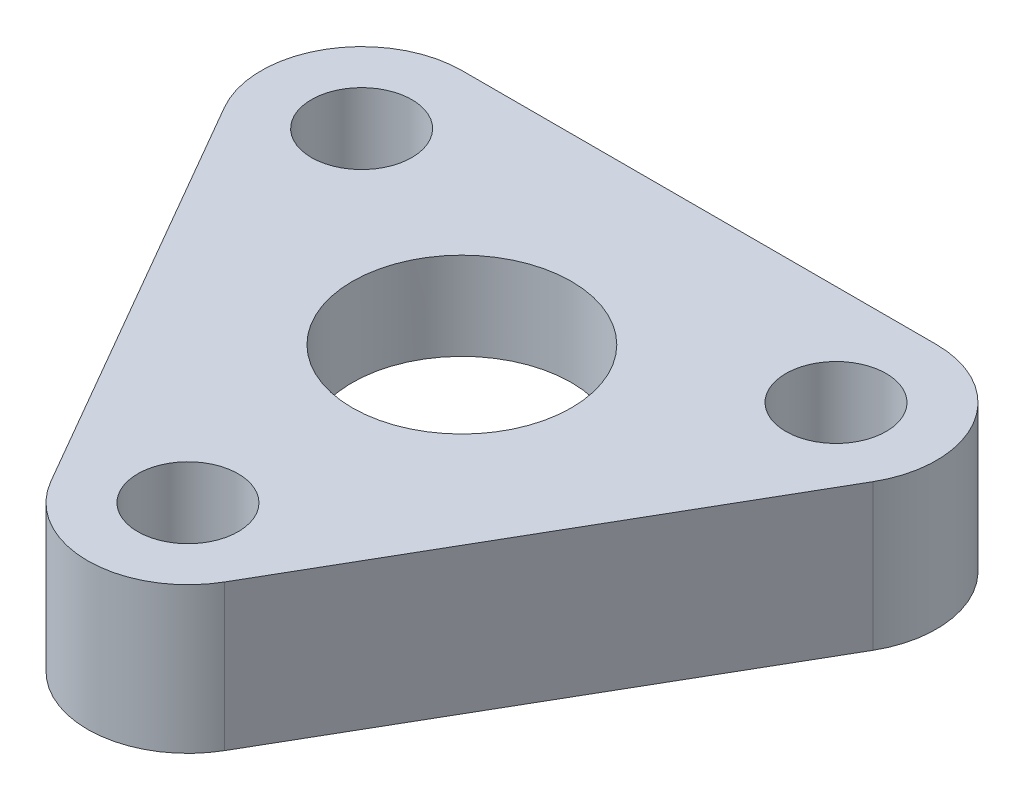
ISO-10303-21;
HEADER;
FILE_DESCRIPTION(('STEP AP214'),'2;1');
FILE_NAME('part.step','',(''),(''),'','','');
FILE_SCHEMA(('AUTOMOTIVE_DESIGN { 1 0 10303 214 1 1 1 1 }'));
ENDSEC;
DATA;
#1=APPLICATION_CONTEXT('core data for automotive mechanical design processes');
#2=APPLICATION_PROTOCOL_DEFINITION('international standard','automotive_design',2000,#1);
#3=PRODUCT_CONTEXT('',#1,'mechanical');
#4=PRODUCT('Part','Part','',(#3));
#5=PRODUCT_RELATED_PRODUCT_CATEGORY('part','',(#4));
#6=PRODUCT_DEFINITION_FORMATION('','',#4);
#7=PRODUCT_DEFINITION_CONTEXT('part definition',#1,'design');
#8=PRODUCT_DEFINITION('design','',#6,#7);
#9=PRODUCT_DEFINITION_SHAPE('','',#8);
#10=(LENGTH_UNIT() NAMED_UNIT(*) SI_UNIT(.MILLI.,.METRE.));
#11=(NAMED_UNIT(*) PLANE_ANGLE_UNIT() SI_UNIT($,.RADIAN.));
#12=(NAMED_UNIT(*) SI_UNIT($,.STERADIAN.) SOLID_ANGLE_UNIT());
#13=UNCERTAINTY_MEASURE_WITH_UNIT(LENGTH_MEASURE(1.E-05),#10,'distance_accuracy_value','');
#14=(GEOMETRIC_REPRESENTATION_CONTEXT(3) GLOBAL_UNCERTAINTY_ASSIGNED_CONTEXT((#13)) GLOBAL_UNIT_ASSIGNED_CONTEXT((#10,
#11,#12)) REPRESENTATION_CONTEXT('',''));
#15=CARTESIAN_POINT('',(0.,0.,0.));
#16=DIRECTION('',(0.,0.,1.));
#17=DIRECTION('',(1.,0.,0.));
#18=AXIS2_PLACEMENT_3D('',#15,#16,#17);
#19=CARTESIAN_POINT('',(0.,8.,0.));
#20=DIRECTION('',(0.,-1.,0.));
#21=DIRECTION('',(0.,0.,-1.));
#22=AXIS2_PLACEMENT_3D('',#19,#20,#21);
#23=CYLINDRICAL_SURFACE('',#22,6.);
#24=CARTESIAN_POINT('',(0.,8.,0.));
#25=DIRECTION('',(0.,1.,0.));
#26=DIRECTION('',(0.,0.,1.));
#27=AXIS2_PLACEMENT_3D('',#24,#25,#26);
#28=CIRCLE('',#27,6.);
#29=CARTESIAN_POINT('',(0.,8.,6.));
#30=VERTEX_POINT('',#29);
#31=EDGE_CURVE('E125',#30,#30,#28,.T.);
#32=ORIENTED_EDGE('',*,*,#31,.T.);
#33=EDGE_LOOP('',(#32));
#34=FACE_BOUND('',#33,.T.);
#35=CARTESIAN_POINT('',(0.,3.2,0.));
#36=DIRECTION('',(0.,-1.,0.));
#37=DIRECTION('',(0.,0.,-1.));
#38=AXIS2_PLACEMENT_3D('',#35,#36,#37);
#39=CIRCLE('',#38,6.);
#40=CARTESIAN_POINT('',(0.,3.2,-6.));
#41=VERTEX_POINT('',#40);
#42=EDGE_CURVE('E38',#41,#41,#39,.T.);
#43=ORIENTED_EDGE('',*,*,#42,.T.);
#44=EDGE_LOOP('',(#43));
#45=FACE_BOUND('',#44,.T.);
#46=ADVANCED_FACE('F34',(#34,#45),#23,.F.);
#47=CARTESIAN_POINT('',(0.,8.,15.0000000000001));
#48=DIRECTION('',(0.,1.,0.));
#49=DIRECTION('',(0.,0.,1.));
#50=AXIS2_PLACEMENT_3D('',#47,#48,#49);
#51=PLANE('',#50);
#52=CARTESIAN_POINT('',(0.,8.,15.0000000000001));
#53=DIRECTION('',(0.,1.,0.));
#54=DIRECTION('',(0.,0.,1.));
#55=AXIS2_PLACEMENT_3D('',#52,#53,#54);
#56=CIRCLE('',#55,2.75000000000007);
#57=CARTESIAN_POINT('',(0.,8.,17.7500000000001));
#58=VERTEX_POINT('',#57);
#59=EDGE_CURVE('E193',#58,#58,#56,.T.);
#60=ORIENTED_EDGE('',*,*,#59,.F.);
#61=EDGE_LOOP('',(#60));
#62=FACE_BOUND('',#61,.T.);
#63=ORIENTED_EDGE('',*,*,#31,.F.);
#64=EDGE_LOOP('',(#63));
#65=FACE_BOUND('',#64,.T.);
#66=CARTESIAN_POINT('',(0.,8.,15.0000000000001));
#67=DIRECTION('',(0.,1.,0.));
#68=DIRECTION('',(0.,0.,1.));
#69=AXIS2_PLACEMENT_3D('',#66,#67,#68);
#70=CIRCLE('',#69,5.5);
#71=CARTESIAN_POINT('',(-4.76313972081441,8.,17.7500000000001));
#72=VERTEX_POINT('',#71);
#73=CARTESIAN_POINT('',(4.76313972081441,8.,17.7500000000001));
#74=VERTEX_POINT('',#73);
#75=EDGE_CURVE('E132',#72,#74,#70,.T.);
#76=ORIENTED_EDGE('',*,*,#75,.T.);
#77=DIRECTION('',(0.500000000000001,0.,-0.866025403784438));
#78=VECTOR('',#77,1.);
#79=CARTESIAN_POINT('',(4.76313972081441,8.,17.7500000000001));
#80=LINE('',#79,#78);
#81=CARTESIAN_POINT('',(17.7535207775811,8.,-4.75));
#82=VERTEX_POINT('',#81);
#83=EDGE_CURVE('E89',#74,#82,#80,.T.);
#84=ORIENTED_EDGE('',*,*,#83,.T.);
#85=CARTESIAN_POINT('',(12.9903810567667,8.,-7.5));
#86=DIRECTION('',(0.,1.,0.));
#87=DIRECTION('',(0.,0.,-1.));
#88=AXIS2_PLACEMENT_3D('',#85,#86,#87);
#89=CIRCLE('',#88,5.5);
#90=CARTESIAN_POINT('',(12.9903810567667,8.,-13.));
#91=VERTEX_POINT('',#90);
#92=EDGE_CURVE('E103',#82,#91,#89,.T.);
#93=ORIENTED_EDGE('',*,*,#92,.T.);
#94=DIRECTION('',(-1.,0.,0.));
#95=VECTOR('',#94,1.);
#96=CARTESIAN_POINT('',(-12.9903810567667,8.,-13.));
#97=LINE('',#96,#95);
#98=CARTESIAN_POINT('',(-12.9903810567667,8.,-13.));
#99=VERTEX_POINT('',#98);
#100=EDGE_CURVE('E96',#91,#99,#97,.T.);
#101=ORIENTED_EDGE('',*,*,#100,.T.);
#102=CARTESIAN_POINT('',(-12.9903810567667,8.,-7.5));
#103=DIRECTION('',(0.,1.,0.));
#104=DIRECTION('',(0.,0.,1.));
#105=AXIS2_PLACEMENT_3D('',#102,#103,#104);
#106=CIRCLE('',#105,5.5);
#107=CARTESIAN_POINT('',(-17.7535207775811,8.,-4.75));
#108=VERTEX_POINT('',#107);
#109=EDGE_CURVE('E101',#99,#108,#106,.T.);
#110=ORIENTED_EDGE('',*,*,#109,.T.);
#111=DIRECTION('',(0.500000000000001,0.,0.866025403784438));
#112=VECTOR('',#111,1.);
#113=CARTESIAN_POINT('',(-4.76313972081441,8.,17.7500000000001));
#114=LINE('',#113,#112);
#115=EDGE_CURVE('E52',#108,#72,#114,.T.);
#116=ORIENTED_EDGE('',*,*,#115,.T.);
#117=EDGE_LOOP('',(#76,#84,#93,#101,#110,#116));
#118=FACE_BOUND('',#117,.T.);
#119=CARTESIAN_POINT('',(12.9903810567666,8.,-7.50000000000002));
#120=DIRECTION('',(0.,1.,0.));
#121=DIRECTION('',(0.,0.,1.));
#122=AXIS2_PLACEMENT_3D('',#119,#120,#121);
#123=CIRCLE('',#122,2.75);
#124=CARTESIAN_POINT('',(12.9903810567666,8.,-4.75000000000002));
#125=VERTEX_POINT('',#124);
#126=EDGE_CURVE('E199',#125,#125,#123,.T.);
#127=ORIENTED_EDGE('',*,*,#126,.F.);
#128=EDGE_LOOP('',(#127));
#129=FACE_BOUND('',#128,.T.);
#130=CARTESIAN_POINT('',(-12.9903810567667,8.,-7.5));
#131=DIRECTION('',(0.,1.,0.));
#132=DIRECTION('',(0.,0.,1.));
#133=AXIS2_PLACEMENT_3D('',#130,#131,#132);
#134=CIRCLE('',#133,2.75);
#135=CARTESIAN_POINT('',(-12.9903810567667,8.,-4.75));
#136=VERTEX_POINT('',#135);
#137=EDGE_CURVE('E186',#136,#136,#134,.T.);
#138=ORIENTED_EDGE('',*,*,#137,.F.);
#139=EDGE_LOOP('',(#138));
#140=FACE_BOUND('',#139,.T.);
#141=ADVANCED_FACE('F98',(#62,#65,#118,#129,#140),#51,.T.);
#142=CARTESIAN_POINT('',(0.,0.,15.0000000000001));
#143=DIRECTION('',(0.,1.,0.));
#144=DIRECTION('',(0.,0.,1.));
#145=AXIS2_PLACEMENT_3D('',#142,#143,#144);
#146=PLANE('',#145);
#147=CARTESIAN_POINT('',(0.,0.,0.));
#148=DIRECTION('',(0.,-1.,0.));
#149=DIRECTION('',(0.,0.,-1.));
#150=AXIS2_PLACEMENT_3D('',#147,#148,#149);
#151=CIRCLE('',#150,11.25);
#152=CARTESIAN_POINT('',(0.,0.,-11.25));
#153=VERTEX_POINT('',#152);
#154=EDGE_CURVE('E179',#153,#153,#151,.T.);
#155=ORIENTED_EDGE('',*,*,#154,.F.);
#156=EDGE_LOOP('',(#155));
#157=FACE_BOUND('',#156,.T.);
#158=CARTESIAN_POINT('',(0.,0.,15.0000000000001));
#159=DIRECTION('',(0.,1.,0.));
#160=DIRECTION('',(0.,0.,1.));
#161=AXIS2_PLACEMENT_3D('',#158,#159,#160);
#162=CIRCLE('',#161,5.5);
#163=CARTESIAN_POINT('',(-4.76313972081441,0.,17.7500000000001));
#164=VERTEX_POINT('',#163);
#165=CARTESIAN_POINT('',(4.76313972081441,0.,17.7500000000001));
#166=VERTEX_POINT('',#165);
#167=EDGE_CURVE('E121',#164,#166,#162,.T.);
#168=ORIENTED_EDGE('',*,*,#167,.F.);
#169=DIRECTION('',(0.500000000000001,0.,0.866025403784438));
#170=VECTOR('',#169,1.);
#171=CARTESIAN_POINT('',(-4.76313972081441,0.,17.7500000000001));
#172=LINE('',#171,#170);
#173=CARTESIAN_POINT('',(-17.7535207775811,0.,-4.75));
#174=VERTEX_POINT('',#173);
#175=EDGE_CURVE('E81',#174,#164,#172,.T.);
#176=ORIENTED_EDGE('',*,*,#175,.F.);
#177=CARTESIAN_POINT('',(-12.9903810567667,0.,-7.5));
#178=DIRECTION('',(0.,1.,0.));
#179=DIRECTION('',(0.,0.,1.));
#180=AXIS2_PLACEMENT_3D('',#177,#178,#179);
#181=CIRCLE('',#180,5.5);
#182=CARTESIAN_POINT('',(-12.9903810567667,0.,-13.));
#183=VERTEX_POINT('',#182);
#184=EDGE_CURVE('E75',#183,#174,#181,.T.);
#185=ORIENTED_EDGE('',*,*,#184,.F.);
#186=DIRECTION('',(-1.,0.,0.));
#187=VECTOR('',#186,1.);
#188=CARTESIAN_POINT('',(-12.9903810567667,0.,-13.));
#189=LINE('',#188,#187);
#190=CARTESIAN_POINT('',(12.9903810567667,0.,-13.));
#191=VERTEX_POINT('',#190);
#192=EDGE_CURVE('E111',#191,#183,#189,.T.);
#193=ORIENTED_EDGE('',*,*,#192,.F.);
#194=CARTESIAN_POINT('',(12.9903810567667,0.,-7.5));
#195=DIRECTION('',(0.,1.,0.));
#196=DIRECTION('',(0.,0.,-1.));
#197=AXIS2_PLACEMENT_3D('',#194,#195,#196);
#198=CIRCLE('',#197,5.5);
#199=CARTESIAN_POINT('',(17.7535207775811,0.,-4.75));
#200=VERTEX_POINT('',#199);
#201=EDGE_CURVE('E127',#200,#191,#198,.T.);
#202=ORIENTED_EDGE('',*,*,#201,.F.);
#203=DIRECTION('',(0.500000000000001,0.,-0.866025403784438));
#204=VECTOR('',#203,1.);
#205=CARTESIAN_POINT('',(4.76313972081441,0.,17.7500000000001));
#206=LINE('',#205,#204);
#207=EDGE_CURVE('E124',#166,#200,#206,.T.);
#208=ORIENTED_EDGE('',*,*,#207,.F.);
#209=EDGE_LOOP('',(#168,#176,#185,#193,#202,#208));
#210=FACE_BOUND('',#209,.T.);
#211=CARTESIAN_POINT('',(12.9903810567666,0.,-7.50000000000002));
#212=DIRECTION('',(0.,1.,0.));
#213=DIRECTION('',(0.,0.,1.));
#214=AXIS2_PLACEMENT_3D('',#211,#212,#213);
#215=CIRCLE('',#214,2.75);
#216=CARTESIAN_POINT('',(12.9903810567666,0.,-4.75000000000002));
#217=VERTEX_POINT('',#216);
#218=EDGE_CURVE('E196',#217,#217,#215,.T.);
#219=ORIENTED_EDGE('',*,*,#218,.T.);
#220=EDGE_LOOP('',(#219));
#221=FACE_BOUND('',#220,.T.);
#222=CARTESIAN_POINT('',(0.,0.,15.0000000000001));
#223=DIRECTION('',(0.,1.,0.));
#224=DIRECTION('',(0.,0.,1.));
#225=AXIS2_PLACEMENT_3D('',#222,#223,#224);
#226=CIRCLE('',#225,2.75000000000007);
#227=CARTESIAN_POINT('',(0.,0.,17.7500000000001));
#228=VERTEX_POINT('',#227);
#229=EDGE_CURVE('E189',#228,#228,#226,.T.);
#230=ORIENTED_EDGE('',*,*,#229,.T.);
#231=EDGE_LOOP('',(#230));
#232=FACE_BOUND('',#231,.T.);
#233=CARTESIAN_POINT('',(-12.9903810567667,0.,-7.5));
#234=DIRECTION('',(0.,1.,0.));
#235=DIRECTION('',(0.,0.,1.));
#236=AXIS2_PLACEMENT_3D('',#233,#234,#235);
#237=CIRCLE('',#236,2.75);
#238=CARTESIAN_POINT('',(-12.9903810567667,0.,-4.75));
#239=VERTEX_POINT('',#238);
#240=EDGE_CURVE('E190',#239,#239,#237,.T.);
#241=ORIENTED_EDGE('',*,*,#240,.T.);
#242=EDGE_LOOP('',(#241));
#243=FACE_BOUND('',#242,.T.);
#244=ADVANCED_FACE('F142',(#157,#210,#221,#232,#243),#146,.F.);
#245=CARTESIAN_POINT('',(0.,8.,15.0000000000001));
#246=DIRECTION('',(0.,-1.,0.));
#247=DIRECTION('',(0.,0.,-1.));
#248=AXIS2_PLACEMENT_3D('',#245,#246,#247);
#249=CYLINDRICAL_SURFACE('',#248,5.5);
#250=ORIENTED_EDGE('',*,*,#167,.T.);
#251=DIRECTION('',(0.,-1.,0.));
#252=VECTOR('',#251,1.);
#253=CARTESIAN_POINT('',(4.76313972081441,8.,17.7500000000001));
#254=LINE('',#253,#252);
#255=EDGE_CURVE('E11',#74,#166,#254,.T.);
#256=ORIENTED_EDGE('',*,*,#255,.F.);
#257=ORIENTED_EDGE('',*,*,#75,.F.);
#258=DIRECTION('',(0.,-1.,0.));
#259=VECTOR('',#258,1.);
#260=CARTESIAN_POINT('',(-4.76313972081441,8.,17.7500000000001));
#261=LINE('',#260,#259);
#262=EDGE_CURVE('E117',#72,#164,#261,.T.);
#263=ORIENTED_EDGE('',*,*,#262,.T.);
#264=EDGE_LOOP('',(#250,#256,#257,#263));
#265=FACE_BOUND('',#264,.T.);
#266=ADVANCED_FACE('F36',(#265),#249,.T.);
#267=CARTESIAN_POINT('',(4.76313972081441,8.,17.7500000000001));
#268=DIRECTION('',(-0.866025403784438,0.,-0.500000000000001));
#269=DIRECTION('',(-0.500000000000001,0.,0.866025403784438));
#270=AXIS2_PLACEMENT_3D('',#267,#268,#269);
#271=PLANE('',#270);
#272=ORIENTED_EDGE('',*,*,#207,.T.);
#273=DIRECTION('',(0.,-1.,0.));
#274=VECTOR('',#273,1.);
#275=CARTESIAN_POINT('',(17.7535207775811,8.,-4.75));
#276=LINE('',#275,#274);
#277=EDGE_CURVE('E44',#82,#200,#276,.T.);
#278=ORIENTED_EDGE('',*,*,#277,.F.);
#279=ORIENTED_EDGE('',*,*,#83,.F.);
#280=ORIENTED_EDGE('',*,*,#255,.T.);
#281=EDGE_LOOP('',(#272,#278,#279,#280));
#282=FACE_BOUND('',#281,.T.);
#283=ADVANCED_FACE('F176',(#282),#271,.F.);
#284=CARTESIAN_POINT('',(12.9903810567667,8.,-7.5));
#285=DIRECTION('',(0.,-1.,0.));
#286=DIRECTION('',(0.,0.,-1.));
#287=AXIS2_PLACEMENT_3D('',#284,#285,#286);
#288=CYLINDRICAL_SURFACE('',#287,5.5);
#289=ORIENTED_EDGE('',*,*,#201,.T.);
#290=DIRECTION('',(0.,-1.,0.));
#291=VECTOR('',#290,1.);
#292=CARTESIAN_POINT('',(12.9903810567667,8.,-13.));
#293=LINE('',#292,#291);
#294=EDGE_CURVE('E112',#91,#191,#293,.T.);
#295=ORIENTED_EDGE('',*,*,#294,.F.);
#296=ORIENTED_EDGE('',*,*,#92,.F.);
#297=ORIENTED_EDGE('',*,*,#277,.T.);
#298=EDGE_LOOP('',(#289,#295,#296,#297));
#299=FACE_BOUND('',#298,.T.);
#300=ADVANCED_FACE('F139',(#299),#288,.T.);
#301=CARTESIAN_POINT('',(-12.9903810567667,8.,-13.));
#302=DIRECTION('',(0.,0.,1.));
#303=DIRECTION('',(1.,0.,0.));
#304=AXIS2_PLACEMENT_3D('',#301,#302,#303);
#305=PLANE('',#304);
#306=ORIENTED_EDGE('',*,*,#192,.T.);
#307=DIRECTION('',(0.,-1.,0.));
#308=VECTOR('',#307,1.);
#309=CARTESIAN_POINT('',(-12.9903810567667,8.,-13.));
#310=LINE('',#309,#308);
#311=EDGE_CURVE('E108',#99,#183,#310,.T.);
#312=ORIENTED_EDGE('',*,*,#311,.F.);
#313=ORIENTED_EDGE('',*,*,#100,.F.);
#314=ORIENTED_EDGE('',*,*,#294,.T.);
#315=EDGE_LOOP('',(#306,#312,#313,#314));
#316=FACE_BOUND('',#315,.T.);
#317=ADVANCED_FACE('F109',(#316),#305,.F.);
#318=CARTESIAN_POINT('',(-12.9903810567667,8.,-7.5));
#319=DIRECTION('',(0.,-1.,0.));
#320=DIRECTION('',(0.,0.,-1.));
#321=AXIS2_PLACEMENT_3D('',#318,#319,#320);
#322=CYLINDRICAL_SURFACE('',#321,5.5);
#323=ORIENTED_EDGE('',*,*,#184,.T.);
#324=DIRECTION('',(0.,-1.,0.));
#325=VECTOR('',#324,1.);
#326=CARTESIAN_POINT('',(-17.7535207775811,8.,-4.75));
#327=LINE('',#326,#325);
#328=EDGE_CURVE('E113',#108,#174,#327,.T.);
#329=ORIENTED_EDGE('',*,*,#328,.F.);
#330=ORIENTED_EDGE('',*,*,#109,.F.);
#331=ORIENTED_EDGE('',*,*,#311,.T.);
#332=EDGE_LOOP('',(#323,#329,#330,#331));
#333=FACE_BOUND('',#332,.T.);
#334=ADVANCED_FACE('F115',(#333),#322,.T.);
#335=CARTESIAN_POINT('',(-4.76313972081441,8.,17.7500000000001));
#336=DIRECTION('',(0.866025403784438,0.,-0.500000000000001));
#337=DIRECTION('',(-0.500000000000001,0.,-0.866025403784438));
#338=AXIS2_PLACEMENT_3D('',#335,#336,#337);
#339=PLANE('',#338);
#340=ORIENTED_EDGE('',*,*,#175,.T.);
#341=ORIENTED_EDGE('',*,*,#262,.F.);
#342=ORIENTED_EDGE('',*,*,#115,.F.);
#343=ORIENTED_EDGE('',*,*,#328,.T.);
#344=EDGE_LOOP('',(#340,#341,#342,#343));
#345=FACE_BOUND('',#344,.T.);
#346=ADVANCED_FACE('F147',(#345),#339,.F.);
#347=CARTESIAN_POINT('',(12.9903810567666,8.,-7.50000000000002));
#348=DIRECTION('',(0.,-1.,0.));
#349=DIRECTION('',(0.,0.,-1.));
#350=AXIS2_PLACEMENT_3D('',#347,#348,#349);
#351=CYLINDRICAL_SURFACE('',#350,2.75);
#352=ORIENTED_EDGE('',*,*,#126,.T.);
#353=EDGE_LOOP('',(#352));
#354=FACE_BOUND('',#353,.T.);
#355=ORIENTED_EDGE('',*,*,#218,.F.);
#356=EDGE_LOOP('',(#355));
#357=FACE_BOUND('',#356,.T.);
#358=ADVANCED_FACE('F149',(#354,#357),#351,.F.);
#359=CARTESIAN_POINT('',(0.,8.,15.0000000000001));
#360=DIRECTION('',(0.,-1.,0.));
#361=DIRECTION('',(0.,0.,-1.));
#362=AXIS2_PLACEMENT_3D('',#359,#360,#361);
#363=CYLINDRICAL_SURFACE('',#362,2.75000000000007);
#364=ORIENTED_EDGE('',*,*,#59,.T.);
#365=EDGE_LOOP('',(#364));
#366=FACE_BOUND('',#365,.T.);
#367=ORIENTED_EDGE('',*,*,#229,.F.);
#368=EDGE_LOOP('',(#367));
#369=FACE_BOUND('',#368,.T.);
#370=ADVANCED_FACE('F155',(#366,#369),#363,.F.);
#371=CARTESIAN_POINT('',(-12.9903810567667,8.,-7.5));
#372=DIRECTION('',(0.,-1.,0.));
#373=DIRECTION('',(0.,0.,-1.));
#374=AXIS2_PLACEMENT_3D('',#371,#372,#373);
#375=CYLINDRICAL_SURFACE('',#374,2.75);
#376=ORIENTED_EDGE('',*,*,#137,.T.);
#377=EDGE_LOOP('',(#376));
#378=FACE_BOUND('',#377,.T.);
#379=ORIENTED_EDGE('',*,*,#240,.F.);
#380=EDGE_LOOP('',(#379));
#381=FACE_BOUND('',#380,.T.);
#382=ADVANCED_FACE('F215',(#378,#381),#375,.F.);
#383=CARTESIAN_POINT('',(0.,3.2,0.));
#384=DIRECTION('',(0.,-1.,0.));
#385=DIRECTION('',(0.,0.,-1.));
#386=AXIS2_PLACEMENT_3D('',#383,#384,#385);
#387=CYLINDRICAL_SURFACE('',#386,11.25);
#388=CARTESIAN_POINT('',(0.,3.2,0.));
#389=DIRECTION('',(0.,-1.,0.));
#390=DIRECTION('',(0.,0.,-1.));
#391=AXIS2_PLACEMENT_3D('',#388,#389,#390);
#392=CIRCLE('',#391,11.25);
#393=CARTESIAN_POINT('',(0.,3.2,-11.25));
#394=VERTEX_POINT('',#393);
#395=EDGE_CURVE('E181',#394,#394,#392,.T.);
#396=ORIENTED_EDGE('',*,*,#395,.F.);
#397=EDGE_LOOP('',(#396));
#398=FACE_BOUND('',#397,.T.);
#399=ORIENTED_EDGE('',*,*,#154,.T.);
#400=EDGE_LOOP('',(#399));
#401=FACE_BOUND('',#400,.T.);
#402=ADVANCED_FACE('F217',(#398,#401),#387,.F.);
#403=CARTESIAN_POINT('',(0.,3.2,0.));
#404=DIRECTION('',(0.,-1.,0.));
#405=DIRECTION('',(0.,0.,-1.));
#406=AXIS2_PLACEMENT_3D('',#403,#404,#405);
#407=PLANE('',#406);
#408=ORIENTED_EDGE('',*,*,#42,.F.);
#409=EDGE_LOOP('',(#408));
#410=FACE_BOUND('',#409,.T.);
#411=ORIENTED_EDGE('',*,*,#395,.T.);
#412=EDGE_LOOP('',(#411));
#413=FACE_BOUND('',#412,.T.);
#414=ADVANCED_FACE('F224',(#410,#413),#407,.T.);
#415=CLOSED_SHELL('',(#46,#141,#244,#266,#283,#300,#317,#334,#346,#358,#370,#382,#402,#414));
#416=MANIFOLD_SOLID_BREP('B2',#415);
#417=ADVANCED_BREP_SHAPE_REPRESENTATION('',(#18,#416),#14);
#418=SHAPE_DEFINITION_REPRESENTATION(#9,#417);
ENDSEC;
END-ISO-10303-21;
